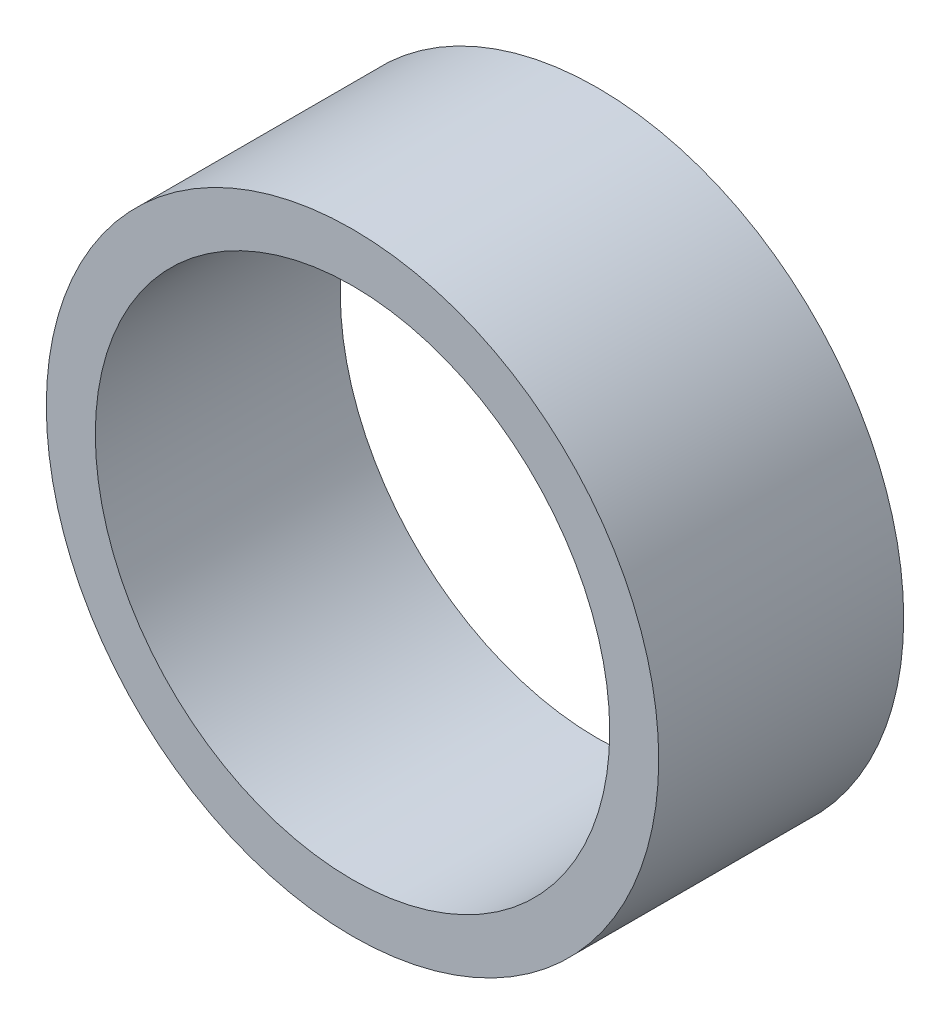
ISO-10303-21;
HEADER;
FILE_DESCRIPTION(('STEP AP214'),'2;1');
FILE_NAME('part.step','',(''),(''),'','','');
FILE_SCHEMA(('AUTOMOTIVE_DESIGN { 1 0 10303 214 1 1 1 1 }'));
ENDSEC;
DATA;
#1=APPLICATION_CONTEXT('core data for automotive mechanical design processes');
#2=APPLICATION_PROTOCOL_DEFINITION('international standard','automotive_design',2000,#1);
#3=PRODUCT_CONTEXT('',#1,'mechanical');
#4=PRODUCT('Part','Part','',(#3));
#5=PRODUCT_RELATED_PRODUCT_CATEGORY('part','',(#4));
#6=PRODUCT_DEFINITION_FORMATION('','',#4);
#7=PRODUCT_DEFINITION_CONTEXT('part definition',#1,'design');
#8=PRODUCT_DEFINITION('design','',#6,#7);
#9=PRODUCT_DEFINITION_SHAPE('','',#8);
#10=(LENGTH_UNIT() NAMED_UNIT(*) SI_UNIT(.MILLI.,.METRE.));
#11=(NAMED_UNIT(*) PLANE_ANGLE_UNIT() SI_UNIT($,.RADIAN.));
#12=(NAMED_UNIT(*) SI_UNIT($,.STERADIAN.) SOLID_ANGLE_UNIT());
#13=UNCERTAINTY_MEASURE_WITH_UNIT(LENGTH_MEASURE(1.E-05),#10,'distance_accuracy_value','');
#14=(GEOMETRIC_REPRESENTATION_CONTEXT(3) GLOBAL_UNCERTAINTY_ASSIGNED_CONTEXT((#13)) GLOBAL_UNIT_ASSIGNED_CONTEXT((#10,
#11,#12)) REPRESENTATION_CONTEXT('',''));
#15=CARTESIAN_POINT('',(0.,0.,0.));
#16=DIRECTION('',(0.,0.,1.));
#17=DIRECTION('',(1.,0.,0.));
#18=AXIS2_PLACEMENT_3D('',#15,#16,#17);
#19=CARTESIAN_POINT('',(0.,8.25,-4.));
#20=DIRECTION('',(0.,0.,1.));
#21=DIRECTION('',(1.,0.,0.));
#22=AXIS2_PLACEMENT_3D('',#19,#20,#21);
#23=CYLINDRICAL_SURFACE('',#22,5.);
#24=CARTESIAN_POINT('',(0.,8.25,-4.));
#25=DIRECTION('',(0.,0.,1.));
#26=DIRECTION('',(1.,0.,0.));
#27=AXIS2_PLACEMENT_3D('',#24,#25,#26);
#28=CIRCLE('',#27,5.);
#29=CARTESIAN_POINT('',(5.,8.25,-4.));
#30=VERTEX_POINT('',#29);
#31=EDGE_CURVE('E10',#30,#30,#28,.T.);
#32=ORIENTED_EDGE('',*,*,#31,.T.);
#33=EDGE_LOOP('',(#32));
#34=FACE_BOUND('',#33,.T.);
#35=CARTESIAN_POINT('',(0.,8.25,0.));
#36=DIRECTION('',(0.,0.,1.));
#37=DIRECTION('',(1.,0.,0.));
#38=AXIS2_PLACEMENT_3D('',#35,#36,#37);
#39=CIRCLE('',#38,5.);
#40=CARTESIAN_POINT('',(5.,8.25,0.));
#41=VERTEX_POINT('',#40);
#42=EDGE_CURVE('E38',#41,#41,#39,.T.);
#43=ORIENTED_EDGE('',*,*,#42,.F.);
#44=EDGE_LOOP('',(#43));
#45=FACE_BOUND('',#44,.T.);
#46=ADVANCED_FACE('F35',(#34,#45),#23,.T.);
#47=CARTESIAN_POINT('',(0.,8.25,-4.));
#48=DIRECTION('',(0.,0.,1.));
#49=DIRECTION('',(1.,0.,0.));
#50=AXIS2_PLACEMENT_3D('',#47,#48,#49);
#51=PLANE('',#50);
#52=CARTESIAN_POINT('',(0.,8.25000000000012,-4.));
#53=DIRECTION('',(0.,0.,1.));
#54=DIRECTION('',(1.,0.,0.));
#55=AXIS2_PLACEMENT_3D('',#52,#53,#54);
#56=CIRCLE('',#55,4.2);
#57=CARTESIAN_POINT('',(4.2,8.25000000000012,-4.));
#58=VERTEX_POINT('',#57);
#59=EDGE_CURVE('E45',#58,#58,#56,.T.);
#60=ORIENTED_EDGE('',*,*,#59,.T.);
#61=EDGE_LOOP('',(#60));
#62=FACE_BOUND('',#61,.T.);
#63=ORIENTED_EDGE('',*,*,#31,.F.);
#64=EDGE_LOOP('',(#63));
#65=FACE_BOUND('',#64,.T.);
#66=ADVANCED_FACE('F53',(#62,#65),#51,.F.);
#67=CARTESIAN_POINT('',(0.,8.25,0.));
#68=DIRECTION('',(0.,0.,1.));
#69=DIRECTION('',(1.,0.,0.));
#70=AXIS2_PLACEMENT_3D('',#67,#68,#69);
#71=PLANE('',#70);
#72=CARTESIAN_POINT('',(0.,8.25000000000012,0.));
#73=DIRECTION('',(0.,0.,1.));
#74=DIRECTION('',(1.,0.,0.));
#75=AXIS2_PLACEMENT_3D('',#72,#73,#74);
#76=CIRCLE('',#75,4.2);
#77=CARTESIAN_POINT('',(4.2,8.25000000000012,0.));
#78=VERTEX_POINT('',#77);
#79=EDGE_CURVE('E47',#78,#78,#76,.T.);
#80=ORIENTED_EDGE('',*,*,#79,.F.);
#81=EDGE_LOOP('',(#80));
#82=FACE_BOUND('',#81,.T.);
#83=ORIENTED_EDGE('',*,*,#42,.T.);
#84=EDGE_LOOP('',(#83));
#85=FACE_BOUND('',#84,.T.);
#86=ADVANCED_FACE('F59',(#82,#85),#71,.T.);
#87=CARTESIAN_POINT('',(0.,8.25000000000012,-4.));
#88=DIRECTION('',(0.,0.,1.));
#89=DIRECTION('',(1.,0.,0.));
#90=AXIS2_PLACEMENT_3D('',#87,#88,#89);
#91=CYLINDRICAL_SURFACE('',#90,4.2);
#92=ORIENTED_EDGE('',*,*,#59,.F.);
#93=EDGE_LOOP('',(#92));
#94=FACE_BOUND('',#93,.T.);
#95=ORIENTED_EDGE('',*,*,#79,.T.);
#96=EDGE_LOOP('',(#95));
#97=FACE_BOUND('',#96,.T.);
#98=ADVANCED_FACE('F56',(#94,#97),#91,.F.);
#99=CLOSED_SHELL('',(#46,#66,#86,#98));
#100=MANIFOLD_SOLID_BREP('B2',#99);
#101=ADVANCED_BREP_SHAPE_REPRESENTATION('',(#18,#100),#14);
#102=SHAPE_DEFINITION_REPRESENTATION(#9,#101);
ENDSEC;
END-ISO-10303-21;
